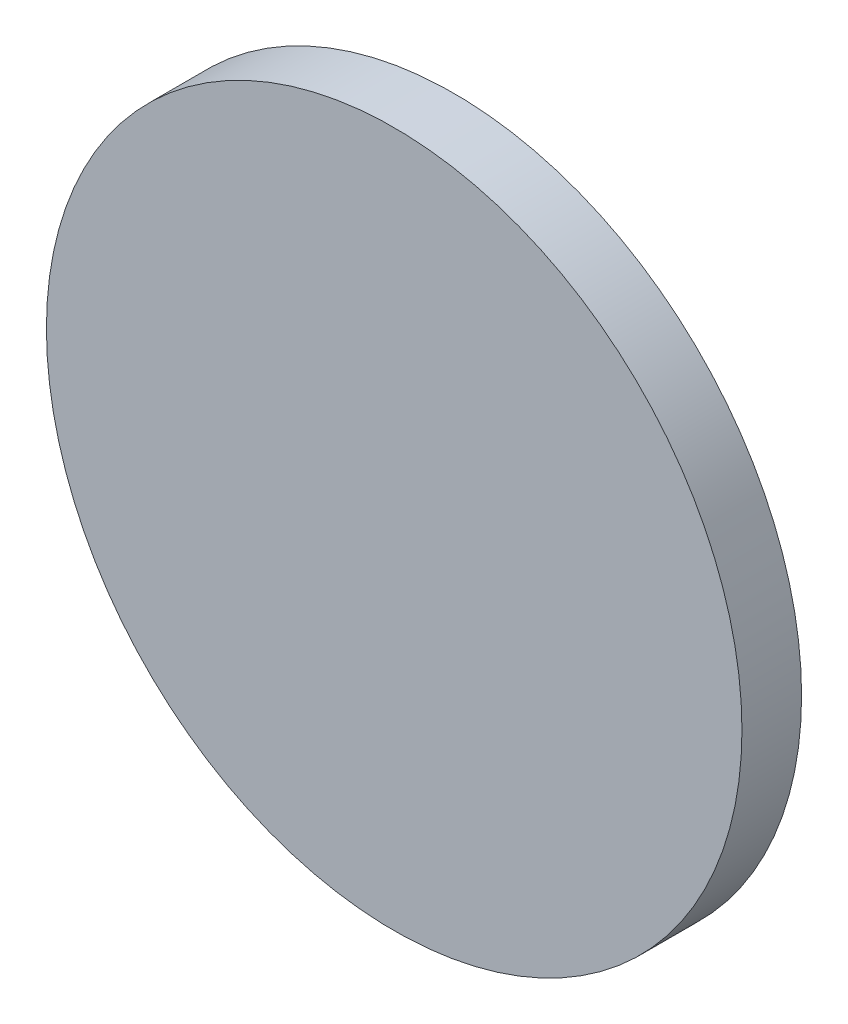
ISO-10303-21;
HEADER;
FILE_DESCRIPTION(('STEP AP214'),'2;1');
FILE_NAME('part.step','',(''),(''),'','','');
FILE_SCHEMA(('AUTOMOTIVE_DESIGN { 1 0 10303 214 1 1 1 1 }'));
ENDSEC;
DATA;
#1=APPLICATION_CONTEXT('core data for automotive mechanical design processes');
#2=APPLICATION_PROTOCOL_DEFINITION('international standard','automotive_design',2000,#1);
#3=PRODUCT_CONTEXT('',#1,'mechanical');
#4=PRODUCT('Part','Part','',(#3));
#5=PRODUCT_RELATED_PRODUCT_CATEGORY('part','',(#4));
#6=PRODUCT_DEFINITION_FORMATION('','',#4);
#7=PRODUCT_DEFINITION_CONTEXT('part definition',#1,'design');
#8=PRODUCT_DEFINITION('design','',#6,#7);
#9=PRODUCT_DEFINITION_SHAPE('','',#8);
#10=(LENGTH_UNIT() NAMED_UNIT(*) SI_UNIT(.MILLI.,.METRE.));
#11=(NAMED_UNIT(*) PLANE_ANGLE_UNIT() SI_UNIT($,.RADIAN.));
#12=(NAMED_UNIT(*) SI_UNIT($,.STERADIAN.) SOLID_ANGLE_UNIT());
#13=UNCERTAINTY_MEASURE_WITH_UNIT(LENGTH_MEASURE(1.E-05),#10,'distance_accuracy_value','');
#14=(GEOMETRIC_REPRESENTATION_CONTEXT(3) GLOBAL_UNCERTAINTY_ASSIGNED_CONTEXT((#13)) GLOBAL_UNIT_ASSIGNED_CONTEXT((#10,
#11,#12)) REPRESENTATION_CONTEXT('',''));
#15=CARTESIAN_POINT('',(0.,0.,0.));
#16=DIRECTION('',(0.,0.,1.));
#17=DIRECTION('',(1.,0.,0.));
#18=AXIS2_PLACEMENT_3D('',#15,#16,#17);
#19=CARTESIAN_POINT('',(5.2578,9.779,0.76487));
#20=DIRECTION('',(0.,0.,-1.));
#21=DIRECTION('',(-1.,0.,0.));
#22=AXIS2_PLACEMENT_3D('',#19,#20,#21);
#23=PLANE('',#22);
#24=CARTESIAN_POINT('',(5.2578,9.779,0.76487));
#25=DIRECTION('',(0.,0.,1.));
#26=DIRECTION('',(1.,0.,0.));
#27=AXIS2_PLACEMENT_3D('',#24,#25,#26);
#28=CIRCLE('',#27,0.200024667);
#29=CARTESIAN_POINT('',(5.457824667,9.779,0.76487));
#30=VERTEX_POINT('',#29);
#31=EDGE_CURVE('E18',#30,#30,#28,.T.);
#32=ORIENTED_EDGE('',*,*,#31,.F.);
#33=EDGE_LOOP('',(#32));
#34=FACE_BOUND('',#33,.T.);
#35=ADVANCED_FACE('F15',(#34),#23,.T.);
#36=CARTESIAN_POINT('',(5.2578,9.779,0.76487));
#37=DIRECTION('',(0.,0.,1.));
#38=DIRECTION('',(1.,0.,0.));
#39=AXIS2_PLACEMENT_3D('',#36,#37,#38);
#40=CYLINDRICAL_SURFACE('',#39,0.200024667);
#41=CARTESIAN_POINT('',(5.2578,9.779,0.79916));
#42=DIRECTION('',(0.,0.,1.));
#43=DIRECTION('',(1.,0.,0.));
#44=AXIS2_PLACEMENT_3D('',#41,#42,#43);
#45=CIRCLE('',#44,0.200024667);
#46=CARTESIAN_POINT('',(5.457824667,9.779,0.79916));
#47=VERTEX_POINT('',#46);
#48=EDGE_CURVE('E10',#47,#47,#45,.T.);
#49=ORIENTED_EDGE('',*,*,#48,.F.);
#50=EDGE_LOOP('',(#49));
#51=FACE_BOUND('',#50,.T.);
#52=ORIENTED_EDGE('',*,*,#31,.T.);
#53=EDGE_LOOP('',(#52));
#54=FACE_BOUND('',#53,.T.);
#55=ADVANCED_FACE('F27',(#51,#54),#40,.T.);
#56=CARTESIAN_POINT('',(5.2578,9.779,0.79916));
#57=DIRECTION('',(0.,0.,1.));
#58=DIRECTION('',(1.,0.,0.));
#59=AXIS2_PLACEMENT_3D('',#56,#57,#58);
#60=PLANE('',#59);
#61=ORIENTED_EDGE('',*,*,#48,.T.);
#62=EDGE_LOOP('',(#61));
#63=FACE_BOUND('',#62,.T.);
#64=ADVANCED_FACE('F34',(#63),#60,.T.);
#65=CLOSED_SHELL('',(#35,#55,#64));
#66=MANIFOLD_SOLID_BREP('B1',#65);
#67=ADVANCED_BREP_SHAPE_REPRESENTATION('',(#18,#66),#14);
#68=SHAPE_DEFINITION_REPRESENTATION(#9,#67);
ENDSEC;
END-ISO-10303-21;
